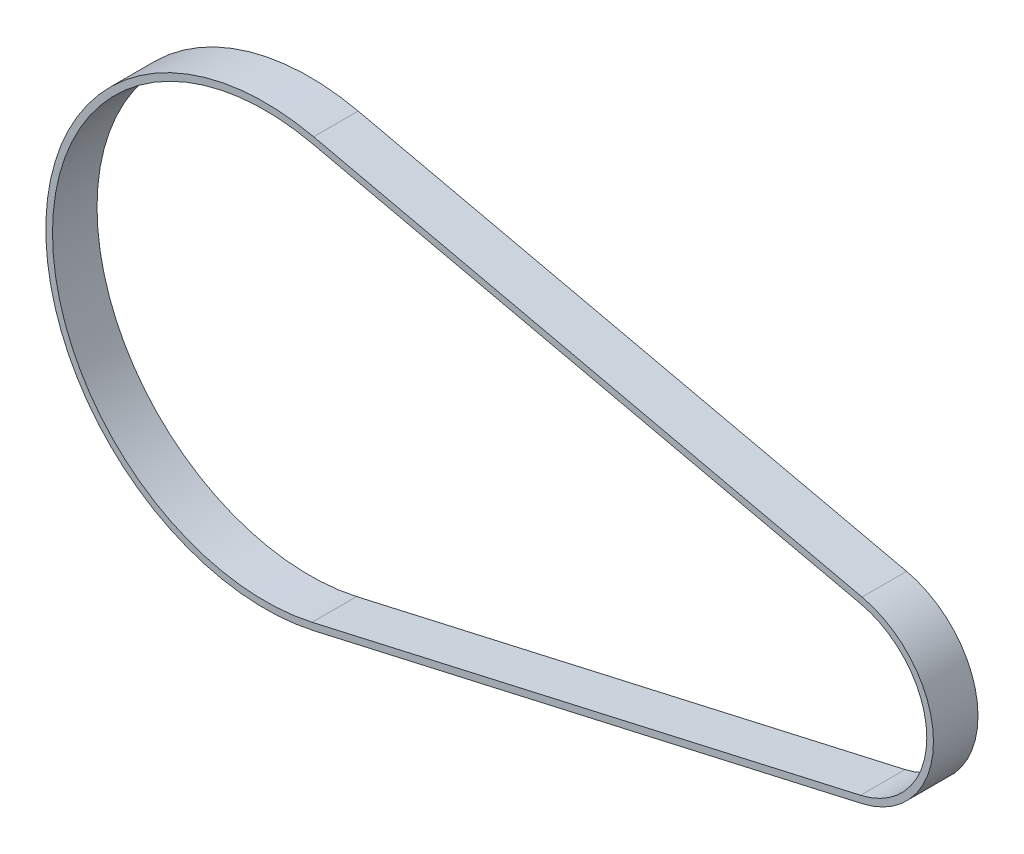
ISO-10303-21;
HEADER;
FILE_DESCRIPTION(('STEP AP214'),'2;1');
FILE_NAME('part.step','',(''),(''),'','','');
FILE_SCHEMA(('AUTOMOTIVE_DESIGN { 1 0 10303 214 1 1 1 1 }'));
ENDSEC;
DATA;
#1=APPLICATION_CONTEXT('core data for automotive mechanical design processes');
#2=APPLICATION_PROTOCOL_DEFINITION('international standard','automotive_design',2000,#1);
#3=PRODUCT_CONTEXT('',#1,'mechanical');
#4=PRODUCT('Part','Part','',(#3));
#5=PRODUCT_RELATED_PRODUCT_CATEGORY('part','',(#4));
#6=PRODUCT_DEFINITION_FORMATION('','',#4);
#7=PRODUCT_DEFINITION_CONTEXT('part definition',#1,'design');
#8=PRODUCT_DEFINITION('design','',#6,#7);
#9=PRODUCT_DEFINITION_SHAPE('','',#8);
#10=(LENGTH_UNIT() NAMED_UNIT(*) SI_UNIT(.MILLI.,.METRE.));
#11=(NAMED_UNIT(*) PLANE_ANGLE_UNIT() SI_UNIT($,.RADIAN.));
#12=(NAMED_UNIT(*) SI_UNIT($,.STERADIAN.) SOLID_ANGLE_UNIT());
#13=UNCERTAINTY_MEASURE_WITH_UNIT(LENGTH_MEASURE(1.E-05),#10,'distance_accuracy_value','');
#14=(GEOMETRIC_REPRESENTATION_CONTEXT(3) GLOBAL_UNCERTAINTY_ASSIGNED_CONTEXT((#13)) GLOBAL_UNIT_ASSIGNED_CONTEXT((#10,
#11,#12)) REPRESENTATION_CONTEXT('',''));
#15=CARTESIAN_POINT('',(0.,0.,0.));
#16=DIRECTION('',(0.,0.,1.));
#17=DIRECTION('',(1.,0.,0.));
#18=AXIS2_PLACEMENT_3D('',#15,#16,#17);
#19=CARTESIAN_POINT('',(-64.75,0.,10.));
#20=DIRECTION('',(0.,0.,1.));
#21=DIRECTION('',(1.,0.,0.));
#22=AXIS2_PLACEMENT_3D('',#19,#20,#21);
#23=PLANE('',#22);
#24=CARTESIAN_POINT('',(-64.75,0.,10.));
#25=DIRECTION('',(0.,0.,1.));
#26=DIRECTION('',(1.,0.,0.));
#27=AXIS2_PLACEMENT_3D('',#24,#25,#26);
#28=CIRCLE('',#27,49.245);
#29=CARTESIAN_POINT('',(-53.8571581081081,48.0251602862317,10.));
#30=VERTEX_POINT('',#29);
#31=CARTESIAN_POINT('',(-53.8571581081081,-48.0251602862317,10.));
#32=VERTEX_POINT('',#31);
#33=EDGE_CURVE('E133',#30,#32,#28,.T.);
#34=ORIENTED_EDGE('',*,*,#33,.T.);
#35=DIRECTION('',(0.975229166133246,0.221196911196911,0.));
#36=VECTOR('',#35,1.);
#37=CARTESIAN_POINT('',(-53.8571581081081,-48.0251602862317,10.));
#38=LINE('',#37,#36);
#39=CARTESIAN_POINT('',(69.3066563706564,-20.0897208223449,10.));
#40=VERTEX_POINT('',#39);
#41=EDGE_CURVE('E136',#32,#40,#38,.T.);
#42=ORIENTED_EDGE('',*,*,#41,.T.);
#43=CARTESIAN_POINT('',(64.75,0.,10.));
#44=DIRECTION('',(0.,0.,1.));
#45=DIRECTION('',(1.,0.,0.));
#46=AXIS2_PLACEMENT_3D('',#43,#44,#45);
#47=CIRCLE('',#46,20.6);
#48=CARTESIAN_POINT('',(69.3066563706564,20.0897208223449,10.));
#49=VERTEX_POINT('',#48);
#50=EDGE_CURVE('E139',#40,#49,#47,.T.);
#51=ORIENTED_EDGE('',*,*,#50,.T.);
#52=DIRECTION('',(-0.975229166133246,0.221196911196911,0.));
#53=VECTOR('',#52,1.);
#54=CARTESIAN_POINT('',(-53.8571581081081,48.0251602862317,10.));
#55=LINE('',#54,#53);
#56=EDGE_CURVE('E141',#49,#30,#55,.T.);
#57=ORIENTED_EDGE('',*,*,#56,.T.);
#58=EDGE_LOOP('',(#34,#42,#51,#57));
#59=FACE_BOUND('',#58,.T.);
#60=DIRECTION('',(-0.975229166133246,0.221196911196911,0.));
#61=VECTOR('',#60,1.);
#62=CARTESIAN_POINT('',(-54.1889534749035,46.5623165370318,10.));
#63=LINE('',#62,#61);
#64=CARTESIAN_POINT('',(68.974861003861,18.626877073145,10.));
#65=VERTEX_POINT('',#64);
#66=CARTESIAN_POINT('',(-54.1889534749035,46.5623165370318,10.));
#67=VERTEX_POINT('',#66);
#68=EDGE_CURVE('E105',#65,#67,#63,.T.);
#69=ORIENTED_EDGE('',*,*,#68,.F.);
#70=CARTESIAN_POINT('',(64.75,0.,10.));
#71=DIRECTION('',(0.,0.,1.));
#72=DIRECTION('',(1.,0.,0.));
#73=AXIS2_PLACEMENT_3D('',#70,#71,#72);
#74=CIRCLE('',#73,19.1);
#75=CARTESIAN_POINT('',(68.974861003861,-18.626877073145,10.));
#76=VERTEX_POINT('',#75);
#77=EDGE_CURVE('E97',#76,#65,#74,.T.);
#78=ORIENTED_EDGE('',*,*,#77,.F.);
#79=DIRECTION('',(0.975229166133246,0.221196911196911,0.));
#80=VECTOR('',#79,1.);
#81=CARTESIAN_POINT('',(-54.1889534749035,-46.5623165370318,10.));
#82=LINE('',#81,#80);
#83=CARTESIAN_POINT('',(-54.1889534749035,-46.5623165370318,10.));
#84=VERTEX_POINT('',#83);
#85=EDGE_CURVE('E119',#84,#76,#82,.T.);
#86=ORIENTED_EDGE('',*,*,#85,.F.);
#87=CARTESIAN_POINT('',(-64.75,0.,10.));
#88=DIRECTION('',(0.,0.,1.));
#89=DIRECTION('',(1.,0.,0.));
#90=AXIS2_PLACEMENT_3D('',#87,#88,#89);
#91=CIRCLE('',#90,47.745);
#92=EDGE_CURVE('E117',#67,#84,#91,.T.);
#93=ORIENTED_EDGE('',*,*,#92,.F.);
#94=EDGE_LOOP('',(#69,#78,#86,#93));
#95=FACE_BOUND('',#94,.T.);
#96=ADVANCED_FACE('F32',(#59,#95),#23,.T.);
#97=CARTESIAN_POINT('',(-64.75,0.,0.));
#98=DIRECTION('',(0.,0.,1.));
#99=DIRECTION('',(1.,0.,0.));
#100=AXIS2_PLACEMENT_3D('',#97,#98,#99);
#101=PLANE('',#100);
#102=CARTESIAN_POINT('',(-64.75,0.,0.));
#103=DIRECTION('',(0.,0.,1.));
#104=DIRECTION('',(1.,0.,0.));
#105=AXIS2_PLACEMENT_3D('',#102,#103,#104);
#106=CIRCLE('',#105,49.245);
#107=CARTESIAN_POINT('',(-53.8571581081081,48.0251602862317,0.));
#108=VERTEX_POINT('',#107);
#109=CARTESIAN_POINT('',(-53.8571581081081,-48.0251602862317,0.));
#110=VERTEX_POINT('',#109);
#111=EDGE_CURVE('E113',#108,#110,#106,.T.);
#112=ORIENTED_EDGE('',*,*,#111,.F.);
#113=DIRECTION('',(-0.975229166133246,0.221196911196911,0.));
#114=VECTOR('',#113,1.);
#115=CARTESIAN_POINT('',(-53.8571581081081,48.0251602862317,0.));
#116=LINE('',#115,#114);
#117=CARTESIAN_POINT('',(69.3066563706564,20.0897208223449,0.));
#118=VERTEX_POINT('',#117);
#119=EDGE_CURVE('E137',#118,#108,#116,.T.);
#120=ORIENTED_EDGE('',*,*,#119,.F.);
#121=CARTESIAN_POINT('',(64.75,0.,0.));
#122=DIRECTION('',(0.,0.,1.));
#123=DIRECTION('',(1.,0.,0.));
#124=AXIS2_PLACEMENT_3D('',#121,#122,#123);
#125=CIRCLE('',#124,20.6);
#126=CARTESIAN_POINT('',(69.3066563706564,-20.0897208223449,0.));
#127=VERTEX_POINT('',#126);
#128=EDGE_CURVE('E148',#127,#118,#125,.T.);
#129=ORIENTED_EDGE('',*,*,#128,.F.);
#130=DIRECTION('',(0.975229166133246,0.221196911196911,0.));
#131=VECTOR('',#130,1.);
#132=CARTESIAN_POINT('',(-53.8571581081081,-48.0251602862317,0.));
#133=LINE('',#132,#131);
#134=EDGE_CURVE('E146',#110,#127,#133,.T.);
#135=ORIENTED_EDGE('',*,*,#134,.F.);
#136=EDGE_LOOP('',(#112,#120,#129,#135));
#137=FACE_BOUND('',#136,.T.);
#138=CARTESIAN_POINT('',(64.75,0.,0.));
#139=DIRECTION('',(0.,0.,1.));
#140=DIRECTION('',(1.,0.,0.));
#141=AXIS2_PLACEMENT_3D('',#138,#139,#140);
#142=CIRCLE('',#141,19.1);
#143=CARTESIAN_POINT('',(68.974861003861,-18.626877073145,0.));
#144=VERTEX_POINT('',#143);
#145=CARTESIAN_POINT('',(68.974861003861,18.626877073145,0.));
#146=VERTEX_POINT('',#145);
#147=EDGE_CURVE('E55',#144,#146,#142,.T.);
#148=ORIENTED_EDGE('',*,*,#147,.T.);
#149=DIRECTION('',(-0.975229166133246,0.221196911196911,0.));
#150=VECTOR('',#149,1.);
#151=CARTESIAN_POINT('',(-54.1889534749035,46.5623165370318,0.));
#152=LINE('',#151,#150);
#153=CARTESIAN_POINT('',(-54.1889534749035,46.5623165370318,0.));
#154=VERTEX_POINT('',#153);
#155=EDGE_CURVE('E112',#146,#154,#152,.T.);
#156=ORIENTED_EDGE('',*,*,#155,.T.);
#157=CARTESIAN_POINT('',(-64.75,0.,0.));
#158=DIRECTION('',(0.,0.,1.));
#159=DIRECTION('',(1.,0.,0.));
#160=AXIS2_PLACEMENT_3D('',#157,#158,#159);
#161=CIRCLE('',#160,47.745);
#162=CARTESIAN_POINT('',(-54.1889534749035,-46.5623165370318,0.));
#163=VERTEX_POINT('',#162);
#164=EDGE_CURVE('E125',#154,#163,#161,.T.);
#165=ORIENTED_EDGE('',*,*,#164,.T.);
#166=DIRECTION('',(0.975229166133246,0.221196911196911,0.));
#167=VECTOR('',#166,1.);
#168=CARTESIAN_POINT('',(-54.1889534749035,-46.5623165370318,0.));
#169=LINE('',#168,#167);
#170=EDGE_CURVE('E106',#163,#144,#169,.T.);
#171=ORIENTED_EDGE('',*,*,#170,.T.);
#172=EDGE_LOOP('',(#148,#156,#165,#171));
#173=FACE_BOUND('',#172,.T.);
#174=ADVANCED_FACE('F166',(#137,#173),#101,.F.);
#175=CARTESIAN_POINT('',(-64.75,0.,10.));
#176=DIRECTION('',(0.,0.,-1.));
#177=DIRECTION('',(-1.,0.,0.));
#178=AXIS2_PLACEMENT_3D('',#175,#176,#177);
#179=CYLINDRICAL_SURFACE('',#178,49.245);
#180=ORIENTED_EDGE('',*,*,#111,.T.);
#181=DIRECTION('',(0.,0.,-1.));
#182=VECTOR('',#181,1.);
#183=CARTESIAN_POINT('',(-53.8571581081081,-48.0251602862317,10.));
#184=LINE('',#183,#182);
#185=EDGE_CURVE('E11',#32,#110,#184,.T.);
#186=ORIENTED_EDGE('',*,*,#185,.F.);
#187=ORIENTED_EDGE('',*,*,#33,.F.);
#188=DIRECTION('',(0.,0.,-1.));
#189=VECTOR('',#188,1.);
#190=CARTESIAN_POINT('',(-53.8571581081081,48.0251602862317,10.));
#191=LINE('',#190,#189);
#192=EDGE_CURVE('E143',#30,#108,#191,.T.);
#193=ORIENTED_EDGE('',*,*,#192,.T.);
#194=EDGE_LOOP('',(#180,#186,#187,#193));
#195=FACE_BOUND('',#194,.T.);
#196=ADVANCED_FACE('F34',(#195),#179,.T.);
#197=CARTESIAN_POINT('',(-53.8571581081081,-48.0251602862317,10.));
#198=DIRECTION('',(-0.221196911196911,0.975229166133246,0.));
#199=DIRECTION('',(-0.975229166133246,-0.221196911196911,0.));
#200=AXIS2_PLACEMENT_3D('',#197,#198,#199);
#201=PLANE('',#200);
#202=ORIENTED_EDGE('',*,*,#134,.T.);
#203=DIRECTION('',(0.,0.,-1.));
#204=VECTOR('',#203,1.);
#205=CARTESIAN_POINT('',(69.3066563706564,-20.0897208223449,10.));
#206=LINE('',#205,#204);
#207=EDGE_CURVE('E40',#40,#127,#206,.T.);
#208=ORIENTED_EDGE('',*,*,#207,.F.);
#209=ORIENTED_EDGE('',*,*,#41,.F.);
#210=ORIENTED_EDGE('',*,*,#185,.T.);
#211=EDGE_LOOP('',(#202,#208,#209,#210));
#212=FACE_BOUND('',#211,.T.);
#213=ADVANCED_FACE('F176',(#212),#201,.F.);
#214=CARTESIAN_POINT('',(64.75,0.,10.));
#215=DIRECTION('',(0.,0.,-1.));
#216=DIRECTION('',(-1.,0.,0.));
#217=AXIS2_PLACEMENT_3D('',#214,#215,#216);
#218=CYLINDRICAL_SURFACE('',#217,20.6);
#219=ORIENTED_EDGE('',*,*,#128,.T.);
#220=DIRECTION('',(0.,0.,-1.));
#221=VECTOR('',#220,1.);
#222=CARTESIAN_POINT('',(69.3066563706564,20.0897208223449,10.));
#223=LINE('',#222,#221);
#224=EDGE_CURVE('E153',#49,#118,#223,.T.);
#225=ORIENTED_EDGE('',*,*,#224,.F.);
#226=ORIENTED_EDGE('',*,*,#50,.F.);
#227=ORIENTED_EDGE('',*,*,#207,.T.);
#228=EDGE_LOOP('',(#219,#225,#226,#227));
#229=FACE_BOUND('',#228,.T.);
#230=ADVANCED_FACE('F160',(#229),#218,.T.);
#231=CARTESIAN_POINT('',(-53.8571581081081,48.0251602862317,10.));
#232=DIRECTION('',(-0.221196911196911,-0.975229166133246,0.));
#233=DIRECTION('',(0.975229166133246,-0.221196911196911,0.));
#234=AXIS2_PLACEMENT_3D('',#231,#232,#233);
#235=PLANE('',#234);
#236=ORIENTED_EDGE('',*,*,#119,.T.);
#237=ORIENTED_EDGE('',*,*,#192,.F.);
#238=ORIENTED_EDGE('',*,*,#56,.F.);
#239=ORIENTED_EDGE('',*,*,#224,.T.);
#240=EDGE_LOOP('',(#236,#237,#238,#239));
#241=FACE_BOUND('',#240,.T.);
#242=ADVANCED_FACE('F170',(#241),#235,.F.);
#243=CARTESIAN_POINT('',(64.75,0.,10.));
#244=DIRECTION('',(0.,0.,-1.));
#245=DIRECTION('',(-1.,0.,0.));
#246=AXIS2_PLACEMENT_3D('',#243,#244,#245);
#247=CYLINDRICAL_SURFACE('',#246,19.1);
#248=ORIENTED_EDGE('',*,*,#147,.F.);
#249=DIRECTION('',(0.,0.,-1.));
#250=VECTOR('',#249,1.);
#251=CARTESIAN_POINT('',(68.974861003861,-18.626877073145,10.));
#252=LINE('',#251,#250);
#253=EDGE_CURVE('E101',#76,#144,#252,.T.);
#254=ORIENTED_EDGE('',*,*,#253,.F.);
#255=ORIENTED_EDGE('',*,*,#77,.T.);
#256=DIRECTION('',(0.,0.,-1.));
#257=VECTOR('',#256,1.);
#258=CARTESIAN_POINT('',(68.974861003861,18.626877073145,10.));
#259=LINE('',#258,#257);
#260=EDGE_CURVE('E100',#65,#146,#259,.T.);
#261=ORIENTED_EDGE('',*,*,#260,.T.);
#262=EDGE_LOOP('',(#248,#254,#255,#261));
#263=FACE_BOUND('',#262,.T.);
#264=ADVANCED_FACE('F99',(#263),#247,.F.);
#265=CARTESIAN_POINT('',(-54.1889534749035,46.5623165370318,10.));
#266=DIRECTION('',(-0.221196911196911,-0.975229166133246,0.));
#267=DIRECTION('',(0.975229166133246,-0.221196911196911,0.));
#268=AXIS2_PLACEMENT_3D('',#265,#266,#267);
#269=PLANE('',#268);
#270=ORIENTED_EDGE('',*,*,#155,.F.);
#271=ORIENTED_EDGE('',*,*,#260,.F.);
#272=ORIENTED_EDGE('',*,*,#68,.T.);
#273=DIRECTION('',(0.,0.,-1.));
#274=VECTOR('',#273,1.);
#275=CARTESIAN_POINT('',(-54.1889534749035,46.5623165370318,10.));
#276=LINE('',#275,#274);
#277=EDGE_CURVE('E114',#67,#154,#276,.T.);
#278=ORIENTED_EDGE('',*,*,#277,.T.);
#279=EDGE_LOOP('',(#270,#271,#272,#278));
#280=FACE_BOUND('',#279,.T.);
#281=ADVANCED_FACE('F109',(#280),#269,.T.);
#282=CARTESIAN_POINT('',(-64.75,0.,10.));
#283=DIRECTION('',(0.,0.,-1.));
#284=DIRECTION('',(-1.,0.,0.));
#285=AXIS2_PLACEMENT_3D('',#282,#283,#284);
#286=CYLINDRICAL_SURFACE('',#285,47.745);
#287=ORIENTED_EDGE('',*,*,#164,.F.);
#288=ORIENTED_EDGE('',*,*,#277,.F.);
#289=ORIENTED_EDGE('',*,*,#92,.T.);
#290=DIRECTION('',(0.,0.,-1.));
#291=VECTOR('',#290,1.);
#292=CARTESIAN_POINT('',(-54.1889534749035,-46.5623165370318,10.));
#293=LINE('',#292,#291);
#294=EDGE_CURVE('E47',#84,#163,#293,.T.);
#295=ORIENTED_EDGE('',*,*,#294,.T.);
#296=EDGE_LOOP('',(#287,#288,#289,#295));
#297=FACE_BOUND('',#296,.T.);
#298=ADVANCED_FACE('F199',(#297),#286,.F.);
#299=CARTESIAN_POINT('',(-54.1889534749035,-46.5623165370318,10.));
#300=DIRECTION('',(-0.221196911196911,0.975229166133246,0.));
#301=DIRECTION('',(-0.975229166133246,-0.221196911196911,0.));
#302=AXIS2_PLACEMENT_3D('',#299,#300,#301);
#303=PLANE('',#302);
#304=ORIENTED_EDGE('',*,*,#170,.F.);
#305=ORIENTED_EDGE('',*,*,#294,.F.);
#306=ORIENTED_EDGE('',*,*,#85,.T.);
#307=ORIENTED_EDGE('',*,*,#253,.T.);
#308=EDGE_LOOP('',(#304,#305,#306,#307));
#309=FACE_BOUND('',#308,.T.);
#310=ADVANCED_FACE('F203',(#309),#303,.T.);
#311=CLOSED_SHELL('',(#96,#174,#196,#213,#230,#242,#264,#281,#298,#310));
#312=MANIFOLD_SOLID_BREP('B2',#311);
#313=ADVANCED_BREP_SHAPE_REPRESENTATION('',(#18,#312),#14);
#314=SHAPE_DEFINITION_REPRESENTATION(#9,#313);
ENDSEC;
END-ISO-10303-21;
